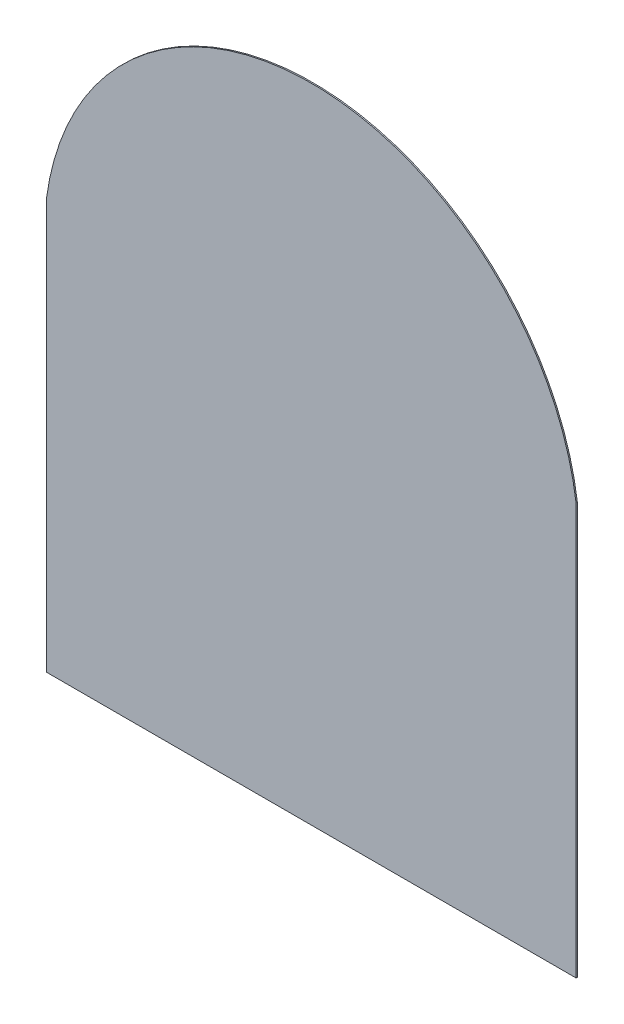
ISO-10303-21;
HEADER;
FILE_DESCRIPTION(('STEP AP214'),'2;1');
FILE_NAME('part.step','',(''),(''),'','','');
FILE_SCHEMA(('AUTOMOTIVE_DESIGN { 1 0 10303 214 1 1 1 1 }'));
ENDSEC;
DATA;
#1=APPLICATION_CONTEXT('core data for automotive mechanical design processes');
#2=APPLICATION_PROTOCOL_DEFINITION('international standard','automotive_design',2000,#1);
#3=PRODUCT_CONTEXT('',#1,'mechanical');
#4=PRODUCT('Part','Part','',(#3));
#5=PRODUCT_RELATED_PRODUCT_CATEGORY('part','',(#4));
#6=PRODUCT_DEFINITION_FORMATION('','',#4);
#7=PRODUCT_DEFINITION_CONTEXT('part definition',#1,'design');
#8=PRODUCT_DEFINITION('design','',#6,#7);
#9=PRODUCT_DEFINITION_SHAPE('','',#8);
#10=(LENGTH_UNIT() NAMED_UNIT(*) SI_UNIT(.MILLI.,.METRE.));
#11=(NAMED_UNIT(*) PLANE_ANGLE_UNIT() SI_UNIT($,.RADIAN.));
#12=(NAMED_UNIT(*) SI_UNIT($,.STERADIAN.) SOLID_ANGLE_UNIT());
#13=UNCERTAINTY_MEASURE_WITH_UNIT(LENGTH_MEASURE(1.E-05),#10,'distance_accuracy_value','');
#14=(GEOMETRIC_REPRESENTATION_CONTEXT(3) GLOBAL_UNCERTAINTY_ASSIGNED_CONTEXT((#13)) GLOBAL_UNIT_ASSIGNED_CONTEXT((#10,
#11,#12)) REPRESENTATION_CONTEXT('',''));
#15=CARTESIAN_POINT('',(0.,0.,0.));
#16=DIRECTION('',(0.,0.,1.));
#17=DIRECTION('',(1.,0.,0.));
#18=AXIS2_PLACEMENT_3D('',#15,#16,#17);
#19=CARTESIAN_POINT('',(-1030.,800.000000000001,2.5));
#20=DIRECTION('',(1.,0.,0.));
#21=DIRECTION('',(0.,0.,-1.));
#22=AXIS2_PLACEMENT_3D('',#19,#20,#21);
#23=PLANE('',#22);
#24=DIRECTION('',(0.,-1.,0.));
#25=VECTOR('',#24,1.);
#26=CARTESIAN_POINT('',(-1030.,800.000000000001,-2.5));
#27=LINE('',#26,#25);
#28=CARTESIAN_POINT('',(-1030.,800.000000000001,-2.5));
#29=VERTEX_POINT('',#28);
#30=CARTESIAN_POINT('',(-1030.,-799.999999999999,-2.5));
#31=VERTEX_POINT('',#30);
#32=EDGE_CURVE('E99',#29,#31,#27,.T.);
#33=ORIENTED_EDGE('',*,*,#32,.T.);
#34=DIRECTION('',(0.,0.,-1.));
#35=VECTOR('',#34,1.);
#36=CARTESIAN_POINT('',(-1030.,-799.999999999999,2.5));
#37=LINE('',#36,#35);
#38=CARTESIAN_POINT('',(-1030.,-799.999999999999,2.5));
#39=VERTEX_POINT('',#38);
#40=EDGE_CURVE('E11',#39,#31,#37,.T.);
#41=ORIENTED_EDGE('',*,*,#40,.F.);
#42=DIRECTION('',(0.,-1.,0.));
#43=VECTOR('',#42,1.);
#44=CARTESIAN_POINT('',(-1030.,800.000000000001,2.5));
#45=LINE('',#44,#43);
#46=CARTESIAN_POINT('',(-1030.,800.000000000001,2.5));
#47=VERTEX_POINT('',#46);
#48=EDGE_CURVE('E87',#47,#39,#45,.T.);
#49=ORIENTED_EDGE('',*,*,#48,.F.);
#50=DIRECTION('',(0.,0.,-1.));
#51=VECTOR('',#50,1.);
#52=CARTESIAN_POINT('',(-1030.,800.000000000001,2.5));
#53=LINE('',#52,#51);
#54=EDGE_CURVE('E95',#47,#29,#53,.T.);
#55=ORIENTED_EDGE('',*,*,#54,.T.);
#56=EDGE_LOOP('',(#33,#41,#49,#55));
#57=FACE_BOUND('',#56,.T.);
#58=ADVANCED_FACE('F36',(#57),#23,.F.);
#59=CARTESIAN_POINT('',(1030.,-799.999999999999,2.5));
#60=DIRECTION('',(0.,1.,0.));
#61=DIRECTION('',(0.,0.,1.));
#62=AXIS2_PLACEMENT_3D('',#59,#60,#61);
#63=PLANE('',#62);
#64=DIRECTION('',(1.,0.,0.));
#65=VECTOR('',#64,1.);
#66=CARTESIAN_POINT('',(1030.,-799.999999999999,-2.5));
#67=LINE('',#66,#65);
#68=CARTESIAN_POINT('',(1030.,-799.999999999999,-2.5));
#69=VERTEX_POINT('',#68);
#70=EDGE_CURVE('E91',#31,#69,#67,.T.);
#71=ORIENTED_EDGE('',*,*,#70,.T.);
#72=DIRECTION('',(0.,0.,-1.));
#73=VECTOR('',#72,1.);
#74=CARTESIAN_POINT('',(1030.,-799.999999999999,2.5));
#75=LINE('',#74,#73);
#76=CARTESIAN_POINT('',(1030.,-799.999999999999,2.5));
#77=VERTEX_POINT('',#76);
#78=EDGE_CURVE('E44',#77,#69,#75,.T.);
#79=ORIENTED_EDGE('',*,*,#78,.F.);
#80=DIRECTION('',(1.,0.,0.));
#81=VECTOR('',#80,1.);
#82=CARTESIAN_POINT('',(1030.,-799.999999999999,2.5));
#83=LINE('',#82,#81);
#84=EDGE_CURVE('E82',#39,#77,#83,.T.);
#85=ORIENTED_EDGE('',*,*,#84,.F.);
#86=ORIENTED_EDGE('',*,*,#40,.T.);
#87=EDGE_LOOP('',(#71,#79,#85,#86));
#88=FACE_BOUND('',#87,.T.);
#89=ADVANCED_FACE('F90',(#88),#63,.F.);
#90=CARTESIAN_POINT('',(1030.,800.000000000001,2.5));
#91=DIRECTION('',(-1.,0.,0.));
#92=DIRECTION('',(0.,-1.,0.));
#93=AXIS2_PLACEMENT_3D('',#90,#91,#92);
#94=PLANE('',#93);
#95=DIRECTION('',(0.,1.,0.));
#96=VECTOR('',#95,1.);
#97=CARTESIAN_POINT('',(1030.,800.000000000001,-2.5));
#98=LINE('',#97,#96);
#99=CARTESIAN_POINT('',(1030.,800.000000000001,-2.5));
#100=VERTEX_POINT('',#99);
#101=EDGE_CURVE('E69',#69,#100,#98,.T.);
#102=ORIENTED_EDGE('',*,*,#101,.T.);
#103=DIRECTION('',(0.,0.,-1.));
#104=VECTOR('',#103,1.);
#105=CARTESIAN_POINT('',(1030.,800.000000000001,2.5));
#106=LINE('',#105,#104);
#107=CARTESIAN_POINT('',(1030.,800.000000000001,2.5));
#108=VERTEX_POINT('',#107);
#109=EDGE_CURVE('E92',#108,#100,#106,.T.);
#110=ORIENTED_EDGE('',*,*,#109,.F.);
#111=DIRECTION('',(0.,1.,0.));
#112=VECTOR('',#111,1.);
#113=CARTESIAN_POINT('',(1030.,800.000000000001,2.5));
#114=LINE('',#113,#112);
#115=EDGE_CURVE('E85',#77,#108,#114,.T.);
#116=ORIENTED_EDGE('',*,*,#115,.F.);
#117=ORIENTED_EDGE('',*,*,#78,.T.);
#118=EDGE_LOOP('',(#102,#110,#116,#117));
#119=FACE_BOUND('',#118,.T.);
#120=ADVANCED_FACE('F93',(#119),#94,.F.);
#121=CARTESIAN_POINT('',(0.,660.611111111113,2.5));
#122=DIRECTION('',(0.,0.,-1.));
#123=DIRECTION('',(-1.,0.,0.));
#124=AXIS2_PLACEMENT_3D('',#121,#122,#123);
#125=CYLINDRICAL_SURFACE('',#124,1039.38888888889);
#126=CARTESIAN_POINT('',(0.,660.611111111113,-2.5));
#127=DIRECTION('',(0.,0.,1.));
#128=DIRECTION('',(-1.,0.,0.));
#129=AXIS2_PLACEMENT_3D('',#126,#127,#128);
#130=CIRCLE('',#129,1039.38888888889);
#131=EDGE_CURVE('E75',#100,#29,#130,.T.);
#132=ORIENTED_EDGE('',*,*,#131,.T.);
#133=ORIENTED_EDGE('',*,*,#54,.F.);
#134=CARTESIAN_POINT('',(0.,660.611111111113,2.5));
#135=DIRECTION('',(0.,0.,1.));
#136=DIRECTION('',(-1.,0.,0.));
#137=AXIS2_PLACEMENT_3D('',#134,#135,#136);
#138=CIRCLE('',#137,1039.38888888889);
#139=EDGE_CURVE('E52',#108,#47,#138,.T.);
#140=ORIENTED_EDGE('',*,*,#139,.F.);
#141=ORIENTED_EDGE('',*,*,#109,.T.);
#142=EDGE_LOOP('',(#132,#133,#140,#141));
#143=FACE_BOUND('',#142,.T.);
#144=ADVANCED_FACE('F106',(#143),#125,.T.);
#145=CARTESIAN_POINT('',(0.,660.611111111113,2.5));
#146=DIRECTION('',(0.,0.,-1.));
#147=DIRECTION('',(-1.,0.,0.));
#148=AXIS2_PLACEMENT_3D('',#145,#146,#147);
#149=PLANE('',#148);
#150=ORIENTED_EDGE('',*,*,#48,.T.);
#151=ORIENTED_EDGE('',*,*,#84,.T.);
#152=ORIENTED_EDGE('',*,*,#115,.T.);
#153=ORIENTED_EDGE('',*,*,#139,.T.);
#154=EDGE_LOOP('',(#150,#151,#152,#153));
#155=FACE_BOUND('',#154,.T.);
#156=ADVANCED_FACE('F83',(#155),#149,.F.);
#157=CARTESIAN_POINT('',(0.,660.611111111113,-2.5));
#158=DIRECTION('',(0.,0.,-1.));
#159=DIRECTION('',(-1.,0.,0.));
#160=AXIS2_PLACEMENT_3D('',#157,#158,#159);
#161=PLANE('',#160);
#162=ORIENTED_EDGE('',*,*,#32,.F.);
#163=ORIENTED_EDGE('',*,*,#131,.F.);
#164=ORIENTED_EDGE('',*,*,#101,.F.);
#165=ORIENTED_EDGE('',*,*,#70,.F.);
#166=EDGE_LOOP('',(#162,#163,#164,#165));
#167=FACE_BOUND('',#166,.T.);
#168=ADVANCED_FACE('F109',(#167),#161,.T.);
#169=CLOSED_SHELL('',(#58,#89,#120,#144,#156,#168));
#170=MANIFOLD_SOLID_BREP('B2',#169);
#171=ADVANCED_BREP_SHAPE_REPRESENTATION('',(#18,#170),#14);
#172=SHAPE_DEFINITION_REPRESENTATION(#9,#171);
ENDSEC;
END-ISO-10303-21;
